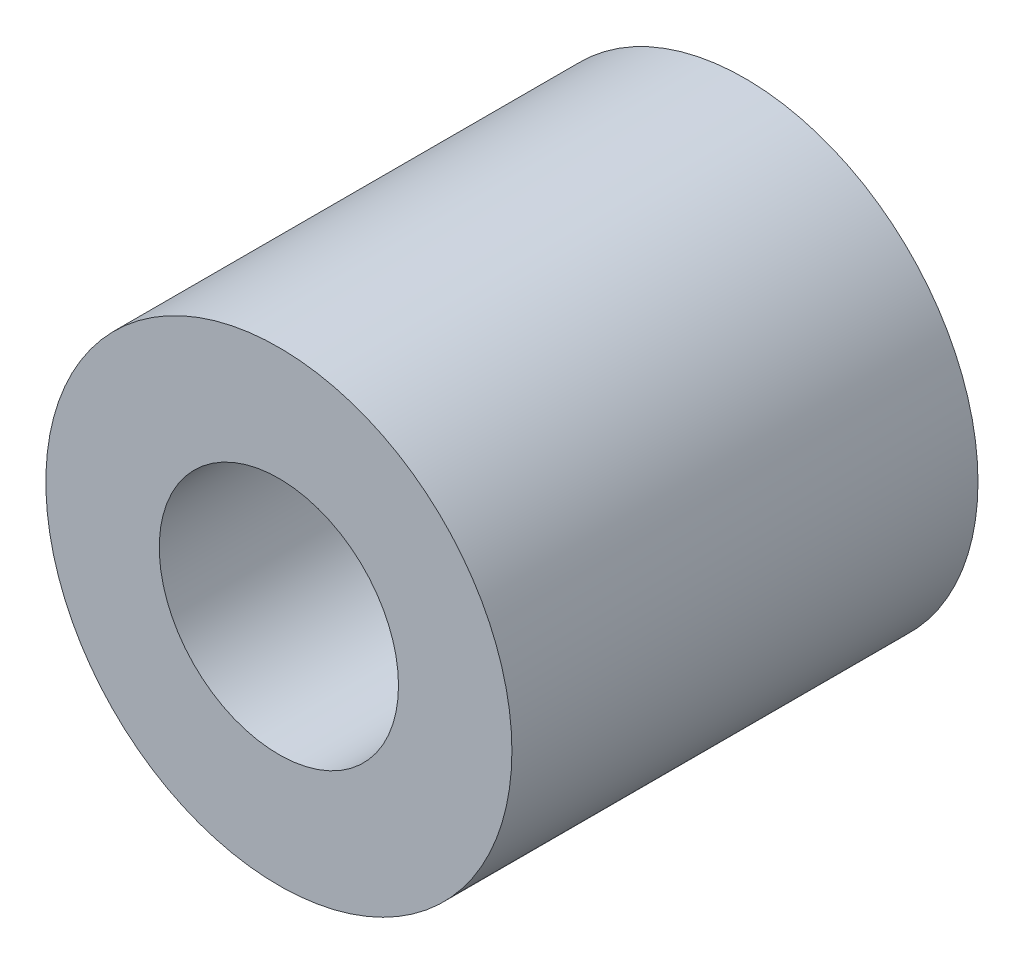
ISO-10303-21;
HEADER;
FILE_DESCRIPTION(('STEP AP214'),'2;1');
FILE_NAME('part.step','',(''),(''),'','','');
FILE_SCHEMA(('AUTOMOTIVE_DESIGN { 1 0 10303 214 1 1 1 1 }'));
ENDSEC;
DATA;
#1=APPLICATION_CONTEXT('core data for automotive mechanical design processes');
#2=APPLICATION_PROTOCOL_DEFINITION('international standard','automotive_design',2000,#1);
#3=PRODUCT_CONTEXT('',#1,'mechanical');
#4=PRODUCT('Part','Part','',(#3));
#5=PRODUCT_RELATED_PRODUCT_CATEGORY('part','',(#4));
#6=PRODUCT_DEFINITION_FORMATION('','',#4);
#7=PRODUCT_DEFINITION_CONTEXT('part definition',#1,'design');
#8=PRODUCT_DEFINITION('design','',#6,#7);
#9=PRODUCT_DEFINITION_SHAPE('','',#8);
#10=(LENGTH_UNIT() NAMED_UNIT(*) SI_UNIT(.MILLI.,.METRE.));
#11=(NAMED_UNIT(*) PLANE_ANGLE_UNIT() SI_UNIT($,.RADIAN.));
#12=(NAMED_UNIT(*) SI_UNIT($,.STERADIAN.) SOLID_ANGLE_UNIT());
#13=UNCERTAINTY_MEASURE_WITH_UNIT(LENGTH_MEASURE(1.E-05),#10,'distance_accuracy_value','');
#14=(GEOMETRIC_REPRESENTATION_CONTEXT(3) GLOBAL_UNCERTAINTY_ASSIGNED_CONTEXT((#13)) GLOBAL_UNIT_ASSIGNED_CONTEXT((#10,
#11,#12)) REPRESENTATION_CONTEXT('',''));
#15=CARTESIAN_POINT('',(0.,0.,0.));
#16=DIRECTION('',(0.,0.,1.));
#17=DIRECTION('',(1.,0.,0.));
#18=AXIS2_PLACEMENT_3D('',#15,#16,#17);
#19=CARTESIAN_POINT('',(0.,0.,6.));
#20=DIRECTION('',(0.,0.,1.));
#21=DIRECTION('',(1.,0.,0.));
#22=AXIS2_PLACEMENT_3D('',#19,#20,#21);
#23=PLANE('',#22);
#24=CARTESIAN_POINT('',(0.,0.,6.));
#25=DIRECTION('',(0.,0.,1.));
#26=DIRECTION('',(1.,0.,0.));
#27=AXIS2_PLACEMENT_3D('',#24,#25,#26);
#28=CIRCLE('',#27,3.);
#29=CARTESIAN_POINT('',(3.,0.,6.));
#30=VERTEX_POINT('',#29);
#31=EDGE_CURVE('E10',#30,#30,#28,.T.);
#32=ORIENTED_EDGE('',*,*,#31,.T.);
#33=EDGE_LOOP('',(#32));
#34=FACE_BOUND('',#33,.T.);
#35=CARTESIAN_POINT('',(0.,0.,6.));
#36=DIRECTION('',(0.,0.,1.));
#37=DIRECTION('',(1.,0.,0.));
#38=AXIS2_PLACEMENT_3D('',#35,#36,#37);
#39=CIRCLE('',#38,1.54);
#40=CARTESIAN_POINT('',(1.54,0.,6.));
#41=VERTEX_POINT('',#40);
#42=EDGE_CURVE('E43',#41,#41,#39,.T.);
#43=ORIENTED_EDGE('',*,*,#42,.F.);
#44=EDGE_LOOP('',(#43));
#45=FACE_BOUND('',#44,.T.);
#46=ADVANCED_FACE('F32',(#34,#45),#23,.T.);
#47=CARTESIAN_POINT('',(0.,0.,0.));
#48=DIRECTION('',(0.,0.,1.));
#49=DIRECTION('',(1.,0.,0.));
#50=AXIS2_PLACEMENT_3D('',#47,#48,#49);
#51=PLANE('',#50);
#52=CARTESIAN_POINT('',(0.,0.,0.));
#53=DIRECTION('',(0.,0.,1.));
#54=DIRECTION('',(1.,0.,0.));
#55=AXIS2_PLACEMENT_3D('',#52,#53,#54);
#56=CIRCLE('',#55,3.);
#57=CARTESIAN_POINT('',(3.,0.,0.));
#58=VERTEX_POINT('',#57);
#59=EDGE_CURVE('E36',#58,#58,#56,.T.);
#60=ORIENTED_EDGE('',*,*,#59,.F.);
#61=EDGE_LOOP('',(#60));
#62=FACE_BOUND('',#61,.T.);
#63=CARTESIAN_POINT('',(0.,0.,0.));
#64=DIRECTION('',(0.,0.,1.));
#65=DIRECTION('',(1.,0.,0.));
#66=AXIS2_PLACEMENT_3D('',#63,#64,#65);
#67=CIRCLE('',#66,1.54);
#68=CARTESIAN_POINT('',(1.54,0.,0.));
#69=VERTEX_POINT('',#68);
#70=EDGE_CURVE('E45',#69,#69,#67,.T.);
#71=ORIENTED_EDGE('',*,*,#70,.T.);
#72=EDGE_LOOP('',(#71));
#73=FACE_BOUND('',#72,.T.);
#74=ADVANCED_FACE('F55',(#62,#73),#51,.F.);
#75=CARTESIAN_POINT('',(0.,0.,6.));
#76=DIRECTION('',(0.,0.,-1.));
#77=DIRECTION('',(-1.,0.,0.));
#78=AXIS2_PLACEMENT_3D('',#75,#76,#77);
#79=CYLINDRICAL_SURFACE('',#78,3.);
#80=ORIENTED_EDGE('',*,*,#31,.F.);
#81=EDGE_LOOP('',(#80));
#82=FACE_BOUND('',#81,.T.);
#83=ORIENTED_EDGE('',*,*,#59,.T.);
#84=EDGE_LOOP('',(#83));
#85=FACE_BOUND('',#84,.T.);
#86=ADVANCED_FACE('F34',(#82,#85),#79,.T.);
#87=CARTESIAN_POINT('',(0.,0.,6.));
#88=DIRECTION('',(0.,0.,-1.));
#89=DIRECTION('',(-1.,0.,0.));
#90=AXIS2_PLACEMENT_3D('',#87,#88,#89);
#91=CYLINDRICAL_SURFACE('',#90,1.54);
#92=ORIENTED_EDGE('',*,*,#42,.T.);
#93=EDGE_LOOP('',(#92));
#94=FACE_BOUND('',#93,.T.);
#95=ORIENTED_EDGE('',*,*,#70,.F.);
#96=EDGE_LOOP('',(#95));
#97=FACE_BOUND('',#96,.T.);
#98=ADVANCED_FACE('F51',(#94,#97),#91,.F.);
#99=CLOSED_SHELL('',(#46,#74,#86,#98));
#100=MANIFOLD_SOLID_BREP('B2',#99);
#101=ADVANCED_BREP_SHAPE_REPRESENTATION('',(#18,#100),#14);
#102=SHAPE_DEFINITION_REPRESENTATION(#9,#101);
ENDSEC;
END-ISO-10303-21;
